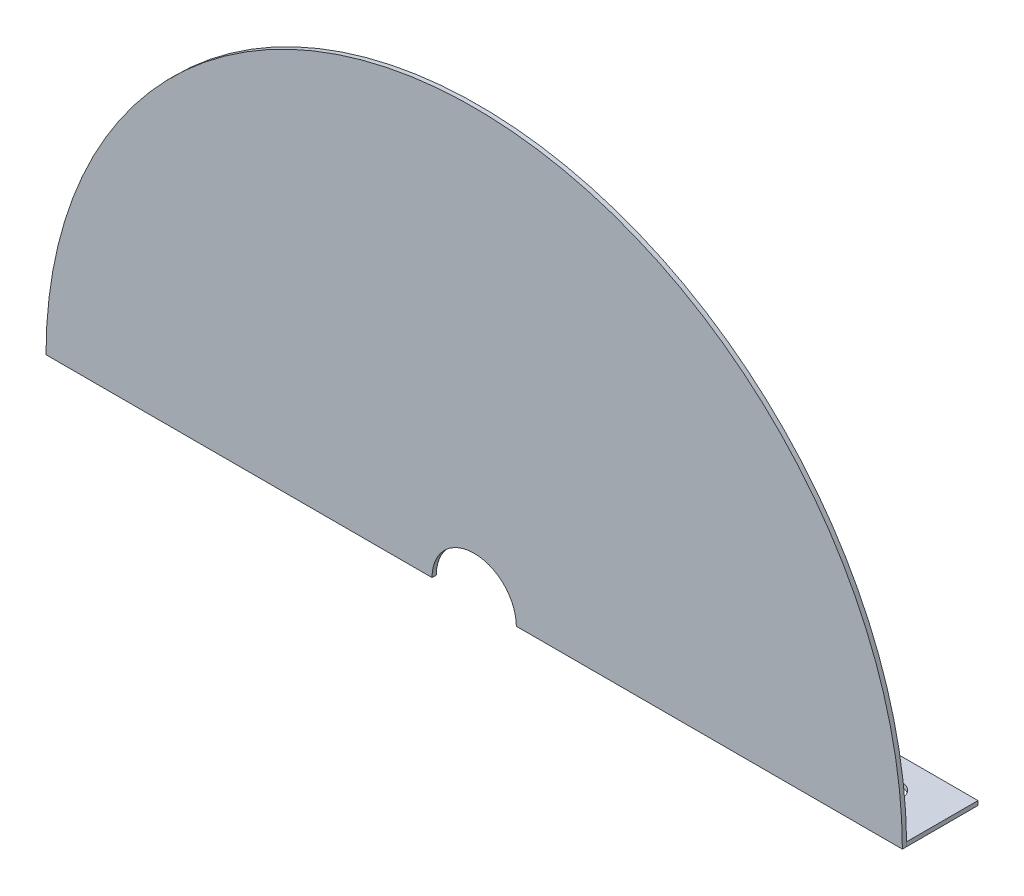
ISO-10303-21;
HEADER;
FILE_DESCRIPTION(('STEP AP214'),'2;1');
FILE_NAME('part.step','',(''),(''),'','','');
FILE_SCHEMA(('AUTOMOTIVE_DESIGN { 1 0 10303 214 1 1 1 1 }'));
ENDSEC;
DATA;
#1=APPLICATION_CONTEXT('core data for automotive mechanical design processes');
#2=APPLICATION_PROTOCOL_DEFINITION('international standard','automotive_design',2000,#1);
#3=PRODUCT_CONTEXT('',#1,'mechanical');
#4=PRODUCT('Part','Part','',(#3));
#5=PRODUCT_RELATED_PRODUCT_CATEGORY('part','',(#4));
#6=PRODUCT_DEFINITION_FORMATION('','',#4);
#7=PRODUCT_DEFINITION_CONTEXT('part definition',#1,'design');
#8=PRODUCT_DEFINITION('design','',#6,#7);
#9=PRODUCT_DEFINITION_SHAPE('','',#8);
#10=(LENGTH_UNIT() NAMED_UNIT(*) SI_UNIT(.MILLI.,.METRE.));
#11=(NAMED_UNIT(*) PLANE_ANGLE_UNIT() SI_UNIT($,.RADIAN.));
#12=(NAMED_UNIT(*) SI_UNIT($,.STERADIAN.) SOLID_ANGLE_UNIT());
#13=UNCERTAINTY_MEASURE_WITH_UNIT(LENGTH_MEASURE(1.E-05),#10,'distance_accuracy_value','');
#14=(GEOMETRIC_REPRESENTATION_CONTEXT(3) GLOBAL_UNCERTAINTY_ASSIGNED_CONTEXT((#13)) GLOBAL_UNIT_ASSIGNED_CONTEXT((#10,
#11,#12)) REPRESENTATION_CONTEXT('',''));
#15=CARTESIAN_POINT('',(0.,0.,0.));
#16=DIRECTION('',(0.,0.,1.));
#17=DIRECTION('',(1.,0.,0.));
#18=AXIS2_PLACEMENT_3D('',#15,#16,#17);
#19=CARTESIAN_POINT('',(0.,152.4,0.));
#20=DIRECTION('',(0.,0.,-1.));
#21=DIRECTION('',(-1.,0.,0.));
#22=AXIS2_PLACEMENT_3D('',#19,#20,#21);
#23=PLANE('',#22);
#24=DIRECTION('',(0.,-1.,0.));
#25=VECTOR('',#24,1.);
#26=CARTESIAN_POINT('',(-76.2,152.4,0.));
#27=LINE('',#26,#25);
#28=CARTESIAN_POINT('',(-76.2,153.91892,0.));
#29=VERTEX_POINT('',#28);
#30=CARTESIAN_POINT('',(-76.2,152.4,0.));
#31=VERTEX_POINT('',#30);
#32=EDGE_CURVE('E144',#29,#31,#27,.T.);
#33=ORIENTED_EDGE('',*,*,#32,.F.);
#34=DIRECTION('',(-1.,0.,0.));
#35=VECTOR('',#34,1.);
#36=CARTESIAN_POINT('',(0.,153.91892,0.));
#37=LINE('',#36,#35);
#38=CARTESIAN_POINT('',(-152.392430527351,153.91892,0.));
#39=VERTEX_POINT('',#38);
#40=EDGE_CURVE('E11',#29,#39,#37,.T.);
#41=ORIENTED_EDGE('',*,*,#40,.T.);
#42=CARTESIAN_POINT('',(0.,152.4,0.));
#43=DIRECTION('',(0.,0.,1.));
#44=DIRECTION('',(-1.,0.,0.));
#45=AXIS2_PLACEMENT_3D('',#42,#43,#44);
#46=CIRCLE('',#45,152.4);
#47=CARTESIAN_POINT('',(152.392430527351,153.91892,0.));
#48=VERTEX_POINT('',#47);
#49=EDGE_CURVE('E203',#48,#39,#46,.T.);
#50=ORIENTED_EDGE('',*,*,#49,.F.);
#51=DIRECTION('',(1.,0.,0.));
#52=VECTOR('',#51,1.);
#53=CARTESIAN_POINT('',(76.2,153.91892,0.));
#54=LINE('',#53,#52);
#55=CARTESIAN_POINT('',(76.2,153.91892,0.));
#56=VERTEX_POINT('',#55);
#57=EDGE_CURVE('E160',#56,#48,#54,.T.);
#58=ORIENTED_EDGE('',*,*,#57,.F.);
#59=DIRECTION('',(0.,1.,0.));
#60=VECTOR('',#59,1.);
#61=CARTESIAN_POINT('',(76.2,152.4,0.));
#62=LINE('',#61,#60);
#63=CARTESIAN_POINT('',(76.2,152.4,0.));
#64=VERTEX_POINT('',#63);
#65=EDGE_CURVE('E57',#64,#56,#62,.T.);
#66=ORIENTED_EDGE('',*,*,#65,.F.);
#67=DIRECTION('',(1.,0.,0.));
#68=VECTOR('',#67,1.);
#69=CARTESIAN_POINT('',(0.,152.4,0.));
#70=LINE('',#69,#68);
#71=CARTESIAN_POINT('',(15.,152.4,0.));
#72=VERTEX_POINT('',#71);
#73=EDGE_CURVE('E202',#72,#64,#70,.T.);
#74=ORIENTED_EDGE('',*,*,#73,.F.);
#75=CARTESIAN_POINT('',(0.,152.4,0.));
#76=DIRECTION('',(0.,0.,-1.));
#77=DIRECTION('',(-1.,0.,0.));
#78=AXIS2_PLACEMENT_3D('',#75,#76,#77);
#79=CIRCLE('',#78,15.);
#80=CARTESIAN_POINT('',(-15.,152.4,0.));
#81=VERTEX_POINT('',#80);
#82=EDGE_CURVE('E42',#81,#72,#79,.T.);
#83=ORIENTED_EDGE('',*,*,#82,.F.);
#84=EDGE_CURVE('E204',#31,#81,#70,.T.);
#85=ORIENTED_EDGE('',*,*,#84,.F.);
#86=EDGE_LOOP('',(#33,#41,#50,#58,#66,#74,#83,#85));
#87=FACE_BOUND('',#86,.T.);
#88=ADVANCED_FACE('F34',(#87),#23,.T.);
#89=CARTESIAN_POINT('',(0.,152.4,1.51892));
#90=DIRECTION('',(0.,1.,0.));
#91=DIRECTION('',(0.,0.,1.));
#92=AXIS2_PLACEMENT_3D('',#89,#90,#91);
#93=PLANE('',#92);
#94=CARTESIAN_POINT('',(-95.25,152.4,-12.7));
#95=DIRECTION('',(0.,1.,0.));
#96=DIRECTION('',(0.,0.,-1.));
#97=AXIS2_PLACEMENT_3D('',#94,#95,#96);
#98=CIRCLE('',#97,4.7625);
#99=CARTESIAN_POINT('',(-95.25,152.4,-17.4625));
#100=VERTEX_POINT('',#99);
#101=EDGE_CURVE('E263',#100,#100,#98,.T.);
#102=ORIENTED_EDGE('',*,*,#101,.T.);
#103=EDGE_LOOP('',(#102));
#104=FACE_BOUND('',#103,.T.);
#105=CARTESIAN_POINT('',(-133.35,152.4,-12.7));
#106=DIRECTION('',(0.,1.,0.));
#107=DIRECTION('',(0.,0.,-1.));
#108=AXIS2_PLACEMENT_3D('',#105,#106,#107);
#109=CIRCLE('',#108,4.76250000000001);
#110=CARTESIAN_POINT('',(-133.35,152.4,-17.4625));
#111=VERTEX_POINT('',#110);
#112=EDGE_CURVE('E253',#111,#111,#109,.T.);
#113=ORIENTED_EDGE('',*,*,#112,.T.);
#114=EDGE_LOOP('',(#113));
#115=FACE_BOUND('',#114,.T.);
#116=DIRECTION('',(0.,0.,-1.));
#117=VECTOR('',#116,1.);
#118=CARTESIAN_POINT('',(-152.4,152.4,1.51892));
#119=LINE('',#118,#117);
#120=CARTESIAN_POINT('',(-152.4,152.4,1.51892));
#121=VERTEX_POINT('',#120);
#122=CARTESIAN_POINT('',(-152.4,152.4,0.));
#123=VERTEX_POINT('',#122);
#124=EDGE_CURVE('E198',#121,#123,#119,.T.);
#125=ORIENTED_EDGE('',*,*,#124,.T.);
#126=DIRECTION('',(0.,0.,1.));
#127=VECTOR('',#126,1.);
#128=CARTESIAN_POINT('',(-152.4,152.4,-25.4));
#129=LINE('',#128,#127);
#130=CARTESIAN_POINT('',(-152.4,152.4,-25.4));
#131=VERTEX_POINT('',#130);
#132=EDGE_CURVE('E267',#131,#123,#129,.T.);
#133=ORIENTED_EDGE('',*,*,#132,.F.);
#134=DIRECTION('',(-1.,0.,0.));
#135=VECTOR('',#134,1.);
#136=CARTESIAN_POINT('',(-152.4,152.4,-25.4));
#137=LINE('',#136,#135);
#138=CARTESIAN_POINT('',(-76.2,152.4,-25.4));
#139=VERTEX_POINT('',#138);
#140=EDGE_CURVE('E141',#139,#131,#137,.T.);
#141=ORIENTED_EDGE('',*,*,#140,.F.);
#142=DIRECTION('',(0.,0.,1.));
#143=VECTOR('',#142,1.);
#144=CARTESIAN_POINT('',(-76.2,152.4,-25.4));
#145=LINE('',#144,#143);
#146=EDGE_CURVE('E49',#139,#31,#145,.T.);
#147=ORIENTED_EDGE('',*,*,#146,.T.);
#148=ORIENTED_EDGE('',*,*,#84,.T.);
#149=DIRECTION('',(0.,0.,1.));
#150=VECTOR('',#149,1.);
#151=CARTESIAN_POINT('',(-15.,152.4,-18.48108));
#152=LINE('',#151,#150);
#153=CARTESIAN_POINT('',(-15.,152.4,1.51892));
#154=VERTEX_POINT('',#153);
#155=EDGE_CURVE('E187',#81,#154,#152,.T.);
#156=ORIENTED_EDGE('',*,*,#155,.T.);
#157=DIRECTION('',(1.,0.,0.));
#158=VECTOR('',#157,1.);
#159=CARTESIAN_POINT('',(0.,152.4,1.51892));
#160=LINE('',#159,#158);
#161=EDGE_CURVE('E191',#121,#154,#160,.T.);
#162=ORIENTED_EDGE('',*,*,#161,.F.);
#163=EDGE_LOOP('',(#125,#133,#141,#147,#148,#156,#162));
#164=FACE_BOUND('',#163,.T.);
#165=ADVANCED_FACE('F222',(#104,#115,#164),#93,.F.);
#166=CARTESIAN_POINT('',(0.,152.4,1.51892));
#167=DIRECTION('',(0.,0.,-1.));
#168=DIRECTION('',(-1.,0.,0.));
#169=AXIS2_PLACEMENT_3D('',#166,#167,#168);
#170=CYLINDRICAL_SURFACE('',#169,152.4);
#171=CARTESIAN_POINT('',(152.4,152.4,0.));
#172=VERTEX_POINT('',#171);
#173=EDGE_CURVE('E199',#172,#48,#46,.T.);
#174=ORIENTED_EDGE('',*,*,#173,.T.);
#175=ORIENTED_EDGE('',*,*,#49,.T.);
#176=EDGE_CURVE('E190',#39,#123,#46,.T.);
#177=ORIENTED_EDGE('',*,*,#176,.T.);
#178=ORIENTED_EDGE('',*,*,#124,.F.);
#179=CARTESIAN_POINT('',(0.,152.4,1.51892));
#180=DIRECTION('',(0.,0.,1.));
#181=DIRECTION('',(-1.,0.,0.));
#182=AXIS2_PLACEMENT_3D('',#179,#180,#181);
#183=CIRCLE('',#182,152.4);
#184=CARTESIAN_POINT('',(152.4,152.4,1.51892));
#185=VERTEX_POINT('',#184);
#186=EDGE_CURVE('E194',#185,#121,#183,.T.);
#187=ORIENTED_EDGE('',*,*,#186,.F.);
#188=DIRECTION('',(0.,0.,-1.));
#189=VECTOR('',#188,1.);
#190=CARTESIAN_POINT('',(152.4,152.4,1.51892));
#191=LINE('',#190,#189);
#192=EDGE_CURVE('E208',#185,#172,#191,.T.);
#193=ORIENTED_EDGE('',*,*,#192,.T.);
#194=EDGE_LOOP('',(#174,#175,#177,#178,#187,#193));
#195=FACE_BOUND('',#194,.T.);
#196=ADVANCED_FACE('F36',(#195),#170,.T.);
#197=CARTESIAN_POINT('',(133.35,152.4,-12.7));
#198=DIRECTION('',(0.,1.,0.));
#199=DIRECTION('',(0.,0.,1.));
#200=AXIS2_PLACEMENT_3D('',#197,#198,#199);
#201=CIRCLE('',#200,4.76250000000001);
#202=CARTESIAN_POINT('',(133.35,152.4,-7.93749999999999));
#203=VERTEX_POINT('',#202);
#204=EDGE_CURVE('E242',#203,#203,#201,.T.);
#205=ORIENTED_EDGE('',*,*,#204,.T.);
#206=EDGE_LOOP('',(#205));
#207=FACE_BOUND('',#206,.T.);
#208=CARTESIAN_POINT('',(95.25,152.4,-12.7));
#209=DIRECTION('',(0.,1.,0.));
#210=DIRECTION('',(0.,0.,1.));
#211=AXIS2_PLACEMENT_3D('',#208,#209,#210);
#212=CIRCLE('',#211,4.7625);
#213=CARTESIAN_POINT('',(95.25,152.4,-7.93749999999999));
#214=VERTEX_POINT('',#213);
#215=EDGE_CURVE('E245',#214,#214,#212,.T.);
#216=ORIENTED_EDGE('',*,*,#215,.T.);
#217=EDGE_LOOP('',(#216));
#218=FACE_BOUND('',#217,.T.);
#219=CARTESIAN_POINT('',(15.,152.4,1.51892));
#220=VERTEX_POINT('',#219);
#221=EDGE_CURVE('E195',#220,#185,#160,.T.);
#222=ORIENTED_EDGE('',*,*,#221,.F.);
#223=DIRECTION('',(0.,0.,1.));
#224=VECTOR('',#223,1.);
#225=CARTESIAN_POINT('',(15.,152.4,-18.48108));
#226=LINE('',#225,#224);
#227=EDGE_CURVE('E184',#220,#72,#226,.F.);
#228=ORIENTED_EDGE('',*,*,#227,.T.);
#229=ORIENTED_EDGE('',*,*,#73,.T.);
#230=DIRECTION('',(0.,0.,1.));
#231=VECTOR('',#230,1.);
#232=CARTESIAN_POINT('',(76.2,152.4,-25.4));
#233=LINE('',#232,#231);
#234=CARTESIAN_POINT('',(76.2,152.4,-25.4));
#235=VERTEX_POINT('',#234);
#236=EDGE_CURVE('E176',#235,#64,#233,.T.);
#237=ORIENTED_EDGE('',*,*,#236,.F.);
#238=DIRECTION('',(-1.,0.,0.));
#239=VECTOR('',#238,1.);
#240=CARTESIAN_POINT('',(152.4,152.4,-25.4));
#241=LINE('',#240,#239);
#242=CARTESIAN_POINT('',(152.4,152.4,-25.4));
#243=VERTEX_POINT('',#242);
#244=EDGE_CURVE('E159',#243,#235,#241,.T.);
#245=ORIENTED_EDGE('',*,*,#244,.F.);
#246=DIRECTION('',(0.,0.,1.));
#247=VECTOR('',#246,1.);
#248=CARTESIAN_POINT('',(152.4,152.4,-25.4));
#249=LINE('',#248,#247);
#250=EDGE_CURVE('E179',#243,#172,#249,.T.);
#251=ORIENTED_EDGE('',*,*,#250,.T.);
#252=ORIENTED_EDGE('',*,*,#192,.F.);
#253=EDGE_LOOP('',(#222,#228,#229,#237,#245,#251,#252));
#254=FACE_BOUND('',#253,.T.);
#255=ADVANCED_FACE('F217',(#207,#218,#254),#93,.F.);
#256=CARTESIAN_POINT('',(0.,152.4,1.51892));
#257=DIRECTION('',(0.,0.,-1.));
#258=DIRECTION('',(-1.,0.,0.));
#259=AXIS2_PLACEMENT_3D('',#256,#257,#258);
#260=PLANE('',#259);
#261=ORIENTED_EDGE('',*,*,#161,.T.);
#262=CARTESIAN_POINT('',(0.,152.4,1.51892));
#263=DIRECTION('',(0.,0.,1.));
#264=DIRECTION('',(1.,0.,0.));
#265=AXIS2_PLACEMENT_3D('',#262,#263,#264);
#266=CIRCLE('',#265,15.);
#267=EDGE_CURVE('E182',#220,#154,#266,.T.);
#268=ORIENTED_EDGE('',*,*,#267,.F.);
#269=ORIENTED_EDGE('',*,*,#221,.T.);
#270=ORIENTED_EDGE('',*,*,#186,.T.);
#271=EDGE_LOOP('',(#261,#268,#269,#270));
#272=FACE_BOUND('',#271,.T.);
#273=ADVANCED_FACE('F229',(#272),#260,.F.);
#274=CARTESIAN_POINT('',(0.,152.4,-18.48108));
#275=DIRECTION('',(0.,0.,1.));
#276=DIRECTION('',(1.,0.,0.));
#277=AXIS2_PLACEMENT_3D('',#274,#275,#276);
#278=CYLINDRICAL_SURFACE('',#277,15.);
#279=ORIENTED_EDGE('',*,*,#82,.T.);
#280=ORIENTED_EDGE('',*,*,#227,.F.);
#281=ORIENTED_EDGE('',*,*,#267,.T.);
#282=ORIENTED_EDGE('',*,*,#155,.F.);
#283=EDGE_LOOP('',(#279,#280,#281,#282));
#284=FACE_BOUND('',#283,.T.);
#285=ADVANCED_FACE('F212',(#284),#278,.F.);
#286=CARTESIAN_POINT('',(152.4,153.91892,-25.4));
#287=DIRECTION('',(-1.,0.,0.));
#288=DIRECTION('',(0.,0.,1.));
#289=AXIS2_PLACEMENT_3D('',#286,#287,#288);
#290=PLANE('',#289);
#291=DIRECTION('',(0.,-1.,0.));
#292=VECTOR('',#291,1.);
#293=CARTESIAN_POINT('',(152.4,153.91892,0.));
#294=LINE('',#293,#292);
#295=CARTESIAN_POINT('',(152.4,153.91892,0.));
#296=VERTEX_POINT('',#295);
#297=EDGE_CURVE('E149',#296,#172,#294,.T.);
#298=ORIENTED_EDGE('',*,*,#297,.T.);
#299=ORIENTED_EDGE('',*,*,#250,.F.);
#300=DIRECTION('',(0.,-1.,0.));
#301=VECTOR('',#300,1.);
#302=CARTESIAN_POINT('',(152.4,153.91892,-25.4));
#303=LINE('',#302,#301);
#304=CARTESIAN_POINT('',(152.4,153.91892,-25.4));
#305=VERTEX_POINT('',#304);
#306=EDGE_CURVE('E156',#305,#243,#303,.T.);
#307=ORIENTED_EDGE('',*,*,#306,.F.);
#308=DIRECTION('',(0.,0.,1.));
#309=VECTOR('',#308,1.);
#310=CARTESIAN_POINT('',(152.4,153.91892,-25.4));
#311=LINE('',#310,#309);
#312=EDGE_CURVE('E165',#305,#296,#311,.T.);
#313=ORIENTED_EDGE('',*,*,#312,.T.);
#314=EDGE_LOOP('',(#298,#299,#307,#313));
#315=FACE_BOUND('',#314,.T.);
#316=ADVANCED_FACE('F283',(#315),#290,.F.);
#317=CARTESIAN_POINT('',(76.2,152.4,-25.4));
#318=DIRECTION('',(1.,0.,0.));
#319=DIRECTION('',(0.,0.,-1.));
#320=AXIS2_PLACEMENT_3D('',#317,#318,#319);
#321=PLANE('',#320);
#322=ORIENTED_EDGE('',*,*,#65,.T.);
#323=DIRECTION('',(0.,0.,1.));
#324=VECTOR('',#323,1.);
#325=CARTESIAN_POINT('',(76.2,153.91892,-25.4));
#326=LINE('',#325,#324);
#327=CARTESIAN_POINT('',(76.2,153.91892,-25.4));
#328=VERTEX_POINT('',#327);
#329=EDGE_CURVE('E173',#328,#56,#326,.T.);
#330=ORIENTED_EDGE('',*,*,#329,.F.);
#331=DIRECTION('',(0.,1.,0.));
#332=VECTOR('',#331,1.);
#333=CARTESIAN_POINT('',(76.2,152.4,-25.4));
#334=LINE('',#333,#332);
#335=EDGE_CURVE('E162',#235,#328,#334,.T.);
#336=ORIENTED_EDGE('',*,*,#335,.F.);
#337=ORIENTED_EDGE('',*,*,#236,.T.);
#338=EDGE_LOOP('',(#322,#330,#336,#337));
#339=FACE_BOUND('',#338,.T.);
#340=ADVANCED_FACE('F293',(#339),#321,.F.);
#341=CARTESIAN_POINT('',(76.2,153.91892,-25.4));
#342=DIRECTION('',(0.,-1.,0.));
#343=DIRECTION('',(0.,0.,-1.));
#344=AXIS2_PLACEMENT_3D('',#341,#342,#343);
#345=PLANE('',#344);
#346=CARTESIAN_POINT('',(133.35,153.91892,-12.7));
#347=DIRECTION('',(0.,1.,0.));
#348=DIRECTION('',(0.,0.,1.));
#349=AXIS2_PLACEMENT_3D('',#346,#347,#348);
#350=CIRCLE('',#349,4.76250000000001);
#351=CARTESIAN_POINT('',(133.35,153.91892,-7.93749999999999));
#352=VERTEX_POINT('',#351);
#353=EDGE_CURVE('E247',#352,#352,#350,.T.);
#354=ORIENTED_EDGE('',*,*,#353,.F.);
#355=EDGE_LOOP('',(#354));
#356=FACE_BOUND('',#355,.T.);
#357=CARTESIAN_POINT('',(95.25,153.91892,-12.7));
#358=DIRECTION('',(0.,1.,0.));
#359=DIRECTION('',(0.,0.,1.));
#360=AXIS2_PLACEMENT_3D('',#357,#358,#359);
#361=CIRCLE('',#360,4.7625);
#362=CARTESIAN_POINT('',(95.25,153.91892,-7.93749999999999));
#363=VERTEX_POINT('',#362);
#364=EDGE_CURVE('E248',#363,#363,#361,.T.);
#365=ORIENTED_EDGE('',*,*,#364,.F.);
#366=EDGE_LOOP('',(#365));
#367=FACE_BOUND('',#366,.T.);
#368=ORIENTED_EDGE('',*,*,#57,.T.);
#369=EDGE_CURVE('E168',#48,#296,#54,.T.);
#370=ORIENTED_EDGE('',*,*,#369,.T.);
#371=ORIENTED_EDGE('',*,*,#312,.F.);
#372=DIRECTION('',(1.,0.,0.));
#373=VECTOR('',#372,1.);
#374=CARTESIAN_POINT('',(76.2,153.91892,-25.4));
#375=LINE('',#374,#373);
#376=EDGE_CURVE('E164',#328,#305,#375,.T.);
#377=ORIENTED_EDGE('',*,*,#376,.F.);
#378=ORIENTED_EDGE('',*,*,#329,.T.);
#379=EDGE_LOOP('',(#368,#370,#371,#377,#378));
#380=FACE_BOUND('',#379,.T.);
#381=ADVANCED_FACE('F289',(#356,#367,#380),#345,.F.);
#382=CARTESIAN_POINT('',(0.,0.,-25.4));
#383=DIRECTION('',(0.,0.,-1.));
#384=DIRECTION('',(-1.,0.,0.));
#385=AXIS2_PLACEMENT_3D('',#382,#383,#384);
#386=PLANE('',#385);
#387=ORIENTED_EDGE('',*,*,#306,.T.);
#388=ORIENTED_EDGE('',*,*,#244,.T.);
#389=ORIENTED_EDGE('',*,*,#335,.T.);
#390=ORIENTED_EDGE('',*,*,#376,.T.);
#391=EDGE_LOOP('',(#387,#388,#389,#390));
#392=FACE_BOUND('',#391,.T.);
#393=ADVANCED_FACE('F296',(#392),#386,.T.);
#394=CARTESIAN_POINT('',(0.,0.,0.));
#395=DIRECTION('',(0.,0.,-1.));
#396=DIRECTION('',(-1.,0.,0.));
#397=AXIS2_PLACEMENT_3D('',#394,#395,#396);
#398=PLANE('',#397);
#399=ORIENTED_EDGE('',*,*,#173,.F.);
#400=ORIENTED_EDGE('',*,*,#297,.F.);
#401=ORIENTED_EDGE('',*,*,#369,.F.);
#402=EDGE_LOOP('',(#399,#400,#401));
#403=FACE_BOUND('',#402,.T.);
#404=ADVANCED_FACE('F287',(#403),#398,.F.);
#405=CARTESIAN_POINT('',(-152.4,153.91892,-25.4));
#406=DIRECTION('',(1.,0.,0.));
#407=DIRECTION('',(0.,0.,-1.));
#408=AXIS2_PLACEMENT_3D('',#405,#406,#407);
#409=PLANE('',#408);
#410=DIRECTION('',(0.,1.,0.));
#411=VECTOR('',#410,1.);
#412=CARTESIAN_POINT('',(-152.4,153.91892,0.));
#413=LINE('',#412,#411);
#414=CARTESIAN_POINT('',(-152.4,153.91892,0.));
#415=VERTEX_POINT('',#414);
#416=EDGE_CURVE('E148',#123,#415,#413,.T.);
#417=ORIENTED_EDGE('',*,*,#416,.T.);
#418=DIRECTION('',(0.,0.,1.));
#419=VECTOR('',#418,1.);
#420=CARTESIAN_POINT('',(-152.4,153.91892,-25.4));
#421=LINE('',#420,#419);
#422=CARTESIAN_POINT('',(-152.4,153.91892,-25.4));
#423=VERTEX_POINT('',#422);
#424=EDGE_CURVE('E130',#423,#415,#421,.T.);
#425=ORIENTED_EDGE('',*,*,#424,.F.);
#426=DIRECTION('',(0.,1.,0.));
#427=VECTOR('',#426,1.);
#428=CARTESIAN_POINT('',(-152.4,153.91892,-25.4));
#429=LINE('',#428,#427);
#430=EDGE_CURVE('E137',#131,#423,#429,.T.);
#431=ORIENTED_EDGE('',*,*,#430,.F.);
#432=ORIENTED_EDGE('',*,*,#132,.T.);
#433=EDGE_LOOP('',(#417,#425,#431,#432));
#434=FACE_BOUND('',#433,.T.);
#435=ADVANCED_FACE('F146',(#434),#409,.F.);
#436=CARTESIAN_POINT('',(-76.2,153.91892,-25.4));
#437=DIRECTION('',(0.,-1.,0.));
#438=DIRECTION('',(0.,0.,-1.));
#439=AXIS2_PLACEMENT_3D('',#436,#437,#438);
#440=PLANE('',#439);
#441=CARTESIAN_POINT('',(-95.25,153.91892,-12.7));
#442=DIRECTION('',(0.,1.,0.));
#443=DIRECTION('',(0.,0.,-1.));
#444=AXIS2_PLACEMENT_3D('',#441,#442,#443);
#445=CIRCLE('',#444,4.7625);
#446=CARTESIAN_POINT('',(-95.25,153.91892,-17.4625));
#447=VERTEX_POINT('',#446);
#448=EDGE_CURVE('E256',#447,#447,#445,.T.);
#449=ORIENTED_EDGE('',*,*,#448,.F.);
#450=EDGE_LOOP('',(#449));
#451=FACE_BOUND('',#450,.T.);
#452=CARTESIAN_POINT('',(-133.35,153.91892,-12.7));
#453=DIRECTION('',(0.,1.,0.));
#454=DIRECTION('',(0.,0.,-1.));
#455=AXIS2_PLACEMENT_3D('',#452,#453,#454);
#456=CIRCLE('',#455,4.76250000000001);
#457=CARTESIAN_POINT('',(-133.35,153.91892,-17.4625));
#458=VERTEX_POINT('',#457);
#459=EDGE_CURVE('E261',#458,#458,#456,.T.);
#460=ORIENTED_EDGE('',*,*,#459,.F.);
#461=EDGE_LOOP('',(#460));
#462=FACE_BOUND('',#461,.T.);
#463=DIRECTION('',(1.,0.,0.));
#464=VECTOR('',#463,1.);
#465=CARTESIAN_POINT('',(-76.2,153.91892,0.));
#466=LINE('',#465,#464);
#467=EDGE_CURVE('E269',#415,#39,#466,.T.);
#468=ORIENTED_EDGE('',*,*,#467,.T.);
#469=ORIENTED_EDGE('',*,*,#40,.F.);
#470=DIRECTION('',(0.,0.,1.));
#471=VECTOR('',#470,1.);
#472=CARTESIAN_POINT('',(-76.2,153.91892,-25.4));
#473=LINE('',#472,#471);
#474=CARTESIAN_POINT('',(-76.2,153.91892,-25.4));
#475=VERTEX_POINT('',#474);
#476=EDGE_CURVE('E133',#475,#29,#473,.T.);
#477=ORIENTED_EDGE('',*,*,#476,.F.);
#478=DIRECTION('',(1.,0.,0.));
#479=VECTOR('',#478,1.);
#480=CARTESIAN_POINT('',(-76.2,153.91892,-25.4));
#481=LINE('',#480,#479);
#482=EDGE_CURVE('E125',#423,#475,#481,.T.);
#483=ORIENTED_EDGE('',*,*,#482,.F.);
#484=ORIENTED_EDGE('',*,*,#424,.T.);
#485=EDGE_LOOP('',(#468,#469,#477,#483,#484));
#486=FACE_BOUND('',#485,.T.);
#487=ADVANCED_FACE('F128',(#451,#462,#486),#440,.F.);
#488=CARTESIAN_POINT('',(-76.2,152.4,-25.4));
#489=DIRECTION('',(-1.,0.,0.));
#490=DIRECTION('',(0.,0.,1.));
#491=AXIS2_PLACEMENT_3D('',#488,#489,#490);
#492=PLANE('',#491);
#493=ORIENTED_EDGE('',*,*,#32,.T.);
#494=ORIENTED_EDGE('',*,*,#146,.F.);
#495=DIRECTION('',(0.,-1.,0.));
#496=VECTOR('',#495,1.);
#497=CARTESIAN_POINT('',(-76.2,152.4,-25.4));
#498=LINE('',#497,#496);
#499=EDGE_CURVE('E136',#475,#139,#498,.T.);
#500=ORIENTED_EDGE('',*,*,#499,.F.);
#501=ORIENTED_EDGE('',*,*,#476,.T.);
#502=EDGE_LOOP('',(#493,#494,#500,#501));
#503=FACE_BOUND('',#502,.T.);
#504=ADVANCED_FACE('F343',(#503),#492,.F.);
#505=CARTESIAN_POINT('',(0.,0.,-25.4));
#506=DIRECTION('',(0.,0.,1.));
#507=DIRECTION('',(1.,0.,0.));
#508=AXIS2_PLACEMENT_3D('',#505,#506,#507);
#509=PLANE('',#508);
#510=ORIENTED_EDGE('',*,*,#430,.T.);
#511=ORIENTED_EDGE('',*,*,#482,.T.);
#512=ORIENTED_EDGE('',*,*,#499,.T.);
#513=ORIENTED_EDGE('',*,*,#140,.T.);
#514=EDGE_LOOP('',(#510,#511,#512,#513));
#515=FACE_BOUND('',#514,.T.);
#516=ADVANCED_FACE('F140',(#515),#509,.F.);
#517=CARTESIAN_POINT('',(0.,0.,0.));
#518=DIRECTION('',(0.,0.,1.));
#519=DIRECTION('',(1.,0.,0.));
#520=AXIS2_PLACEMENT_3D('',#517,#518,#519);
#521=PLANE('',#520);
#522=ORIENTED_EDGE('',*,*,#176,.F.);
#523=ORIENTED_EDGE('',*,*,#467,.F.);
#524=ORIENTED_EDGE('',*,*,#416,.F.);
#525=EDGE_LOOP('',(#522,#523,#524));
#526=FACE_BOUND('',#525,.T.);
#527=ADVANCED_FACE('F274',(#526),#521,.T.);
#528=CARTESIAN_POINT('',(-133.35,152.4,-12.7));
#529=DIRECTION('',(0.,1.,0.));
#530=DIRECTION('',(0.,0.,1.));
#531=AXIS2_PLACEMENT_3D('',#528,#529,#530);
#532=CYLINDRICAL_SURFACE('',#531,4.76250000000001);
#533=ORIENTED_EDGE('',*,*,#112,.F.);
#534=EDGE_LOOP('',(#533));
#535=FACE_BOUND('',#534,.T.);
#536=ORIENTED_EDGE('',*,*,#459,.T.);
#537=EDGE_LOOP('',(#536));
#538=FACE_BOUND('',#537,.T.);
#539=ADVANCED_FACE('F352',(#535,#538),#532,.F.);
#540=CARTESIAN_POINT('',(-95.25,152.4,-12.7));
#541=DIRECTION('',(0.,1.,0.));
#542=DIRECTION('',(0.,0.,1.));
#543=AXIS2_PLACEMENT_3D('',#540,#541,#542);
#544=CYLINDRICAL_SURFACE('',#543,4.7625);
#545=ORIENTED_EDGE('',*,*,#101,.F.);
#546=EDGE_LOOP('',(#545));
#547=FACE_BOUND('',#546,.T.);
#548=ORIENTED_EDGE('',*,*,#448,.T.);
#549=EDGE_LOOP('',(#548));
#550=FACE_BOUND('',#549,.T.);
#551=ADVANCED_FACE('F357',(#547,#550),#544,.F.);
#552=CARTESIAN_POINT('',(95.25,152.4,-12.7));
#553=DIRECTION('',(0.,1.,0.));
#554=DIRECTION('',(0.,0.,1.));
#555=AXIS2_PLACEMENT_3D('',#552,#553,#554);
#556=CYLINDRICAL_SURFACE('',#555,4.7625);
#557=ORIENTED_EDGE('',*,*,#215,.F.);
#558=EDGE_LOOP('',(#557));
#559=FACE_BOUND('',#558,.T.);
#560=ORIENTED_EDGE('',*,*,#364,.T.);
#561=EDGE_LOOP('',(#560));
#562=FACE_BOUND('',#561,.T.);
#563=ADVANCED_FACE('F369',(#559,#562),#556,.F.);
#564=CARTESIAN_POINT('',(133.35,152.4,-12.7));
#565=DIRECTION('',(0.,1.,0.));
#566=DIRECTION('',(0.,0.,1.));
#567=AXIS2_PLACEMENT_3D('',#564,#565,#566);
#568=CYLINDRICAL_SURFACE('',#567,4.76250000000001);
#569=ORIENTED_EDGE('',*,*,#204,.F.);
#570=EDGE_LOOP('',(#569));
#571=FACE_BOUND('',#570,.T.);
#572=ORIENTED_EDGE('',*,*,#353,.T.);
#573=EDGE_LOOP('',(#572));
#574=FACE_BOUND('',#573,.T.);
#575=ADVANCED_FACE('F379',(#571,#574),#568,.F.);
#576=CLOSED_SHELL('',(#88,#165,#196,#255,#273,#285,#316,#340,#381,#393,#404,#435,#487,#504,#516,
#527,#539,#551,#563,#575));
#577=MANIFOLD_SOLID_BREP('B2',#576);
#578=ADVANCED_BREP_SHAPE_REPRESENTATION('',(#18,#577),#14);
#579=SHAPE_DEFINITION_REPRESENTATION(#9,#578);
ENDSEC;
END-ISO-10303-21;
